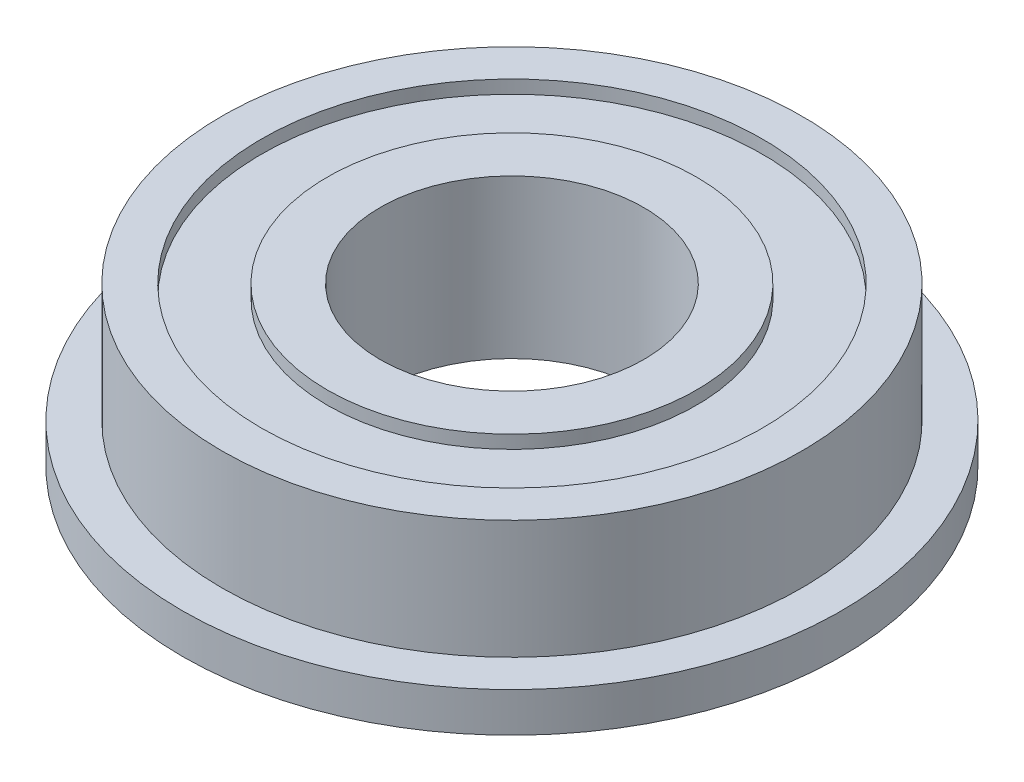
ISO-10303-21;
HEADER;
FILE_DESCRIPTION(('STEP AP214'),'2;1');
FILE_NAME('part.step','',(''),(''),'','','');
FILE_SCHEMA(('AUTOMOTIVE_DESIGN { 1 0 10303 214 1 1 1 1 }'));
ENDSEC;
DATA;
#1=APPLICATION_CONTEXT('core data for automotive mechanical design processes');
#2=APPLICATION_PROTOCOL_DEFINITION('international standard','automotive_design',2000,#1);
#3=PRODUCT_CONTEXT('',#1,'mechanical');
#4=PRODUCT('Part','Part','',(#3));
#5=PRODUCT_RELATED_PRODUCT_CATEGORY('part','',(#4));
#6=PRODUCT_DEFINITION_FORMATION('','',#4);
#7=PRODUCT_DEFINITION_CONTEXT('part definition',#1,'design');
#8=PRODUCT_DEFINITION('design','',#6,#7);
#9=PRODUCT_DEFINITION_SHAPE('','',#8);
#10=(LENGTH_UNIT() NAMED_UNIT(*) SI_UNIT(.MILLI.,.METRE.));
#11=(NAMED_UNIT(*) PLANE_ANGLE_UNIT() SI_UNIT($,.RADIAN.));
#12=(NAMED_UNIT(*) SI_UNIT($,.STERADIAN.) SOLID_ANGLE_UNIT());
#13=UNCERTAINTY_MEASURE_WITH_UNIT(LENGTH_MEASURE(1.E-05),#10,'distance_accuracy_value','');
#14=(GEOMETRIC_REPRESENTATION_CONTEXT(3) GLOBAL_UNCERTAINTY_ASSIGNED_CONTEXT((#13)) GLOBAL_UNIT_ASSIGNED_CONTEXT((#10,
#11,#12)) REPRESENTATION_CONTEXT('',''));
#15=CARTESIAN_POINT('',(0.,0.,0.));
#16=DIRECTION('',(0.,0.,1.));
#17=DIRECTION('',(1.,0.,0.));
#18=AXIS2_PLACEMENT_3D('',#15,#16,#17);
#19=CARTESIAN_POINT('',(0.,6.,0.));
#20=DIRECTION('',(0.,1.,0.));
#21=DIRECTION('',(0.,0.,1.));
#22=AXIS2_PLACEMENT_3D('',#19,#20,#21);
#23=PLANE('',#22);
#24=CARTESIAN_POINT('',(0.,6.,0.));
#25=DIRECTION('',(0.,1.,0.));
#26=DIRECTION('',(0.,0.,1.));
#27=AXIS2_PLACEMENT_3D('',#24,#25,#26);
#28=CIRCLE('',#27,5.);
#29=CARTESIAN_POINT('',(0.,6.,5.));
#30=VERTEX_POINT('',#29);
#31=EDGE_CURVE('E56',#30,#30,#28,.T.);
#32=ORIENTED_EDGE('',*,*,#31,.F.);
#33=EDGE_LOOP('',(#32));
#34=FACE_BOUND('',#33,.T.);
#35=CARTESIAN_POINT('',(0.,6.,0.));
#36=DIRECTION('',(0.,1.,0.));
#37=DIRECTION('',(0.,0.,1.));
#38=AXIS2_PLACEMENT_3D('',#35,#36,#37);
#39=CIRCLE('',#38,7.);
#40=CARTESIAN_POINT('',(0.,6.,7.));
#41=VERTEX_POINT('',#40);
#42=EDGE_CURVE('E78',#41,#41,#39,.T.);
#43=ORIENTED_EDGE('',*,*,#42,.T.);
#44=EDGE_LOOP('',(#43));
#45=FACE_BOUND('',#44,.T.);
#46=ADVANCED_FACE('F36',(#34,#45),#23,.T.);
#47=CARTESIAN_POINT('',(0.,0.,0.));
#48=DIRECTION('',(0.,1.,0.));
#49=DIRECTION('',(0.,0.,1.));
#50=AXIS2_PLACEMENT_3D('',#47,#48,#49);
#51=PLANE('',#50);
#52=CARTESIAN_POINT('',(0.,0.,0.));
#53=DIRECTION('',(0.,1.,0.));
#54=DIRECTION('',(0.,0.,1.));
#55=AXIS2_PLACEMENT_3D('',#52,#53,#54);
#56=CIRCLE('',#55,5.);
#57=CARTESIAN_POINT('',(0.,0.,5.));
#58=VERTEX_POINT('',#57);
#59=EDGE_CURVE('E53',#58,#58,#56,.T.);
#60=ORIENTED_EDGE('',*,*,#59,.T.);
#61=EDGE_LOOP('',(#60));
#62=FACE_BOUND('',#61,.T.);
#63=CARTESIAN_POINT('',(0.,0.,0.));
#64=DIRECTION('',(0.,-1.,0.));
#65=DIRECTION('',(0.,0.,-1.));
#66=AXIS2_PLACEMENT_3D('',#63,#64,#65);
#67=CIRCLE('',#66,7.);
#68=CARTESIAN_POINT('',(0.,0.,-7.));
#69=VERTEX_POINT('',#68);
#70=EDGE_CURVE('E66',#69,#69,#67,.T.);
#71=ORIENTED_EDGE('',*,*,#70,.T.);
#72=EDGE_LOOP('',(#71));
#73=FACE_BOUND('',#72,.T.);
#74=ADVANCED_FACE('F116',(#62,#73),#51,.F.);
#75=CARTESIAN_POINT('',(0.,1.5,0.));
#76=DIRECTION('',(0.,-1.,0.));
#77=DIRECTION('',(0.,0.,-1.));
#78=AXIS2_PLACEMENT_3D('',#75,#76,#77);
#79=CYLINDRICAL_SURFACE('',#78,12.5);
#80=CARTESIAN_POINT('',(0.,1.5,0.));
#81=DIRECTION('',(0.,1.,0.));
#82=DIRECTION('',(0.,0.,1.));
#83=AXIS2_PLACEMENT_3D('',#80,#81,#82);
#84=CIRCLE('',#83,12.5);
#85=CARTESIAN_POINT('',(0.,1.5,12.5));
#86=VERTEX_POINT('',#85);
#87=EDGE_CURVE('E44',#86,#86,#84,.T.);
#88=ORIENTED_EDGE('',*,*,#87,.F.);
#89=EDGE_LOOP('',(#88));
#90=FACE_BOUND('',#89,.T.);
#91=CARTESIAN_POINT('',(0.,0.,0.));
#92=DIRECTION('',(0.,1.,0.));
#93=DIRECTION('',(0.,0.,1.));
#94=AXIS2_PLACEMENT_3D('',#91,#92,#93);
#95=CIRCLE('',#94,12.5);
#96=CARTESIAN_POINT('',(0.,0.,12.5));
#97=VERTEX_POINT('',#96);
#98=EDGE_CURVE('E40',#97,#97,#95,.T.);
#99=ORIENTED_EDGE('',*,*,#98,.T.);
#100=EDGE_LOOP('',(#99));
#101=FACE_BOUND('',#100,.T.);
#102=ADVANCED_FACE('F38',(#90,#101),#79,.T.);
#103=CARTESIAN_POINT('',(0.,1.5,0.));
#104=DIRECTION('',(0.,1.,0.));
#105=DIRECTION('',(0.,0.,1.));
#106=AXIS2_PLACEMENT_3D('',#103,#104,#105);
#107=PLANE('',#106);
#108=CARTESIAN_POINT('',(0.,1.5,0.));
#109=DIRECTION('',(0.,1.,0.));
#110=DIRECTION('',(0.,0.,1.));
#111=AXIS2_PLACEMENT_3D('',#108,#109,#110);
#112=CIRCLE('',#111,11.);
#113=CARTESIAN_POINT('',(0.,1.5,11.));
#114=VERTEX_POINT('',#113);
#115=EDGE_CURVE('E10',#114,#114,#112,.T.);
#116=ORIENTED_EDGE('',*,*,#115,.F.);
#117=EDGE_LOOP('',(#116));
#118=FACE_BOUND('',#117,.T.);
#119=ORIENTED_EDGE('',*,*,#87,.T.);
#120=EDGE_LOOP('',(#119));
#121=FACE_BOUND('',#120,.T.);
#122=ADVANCED_FACE('F114',(#118,#121),#107,.T.);
#123=CARTESIAN_POINT('',(0.,0.,0.));
#124=DIRECTION('',(0.,-1.,0.));
#125=DIRECTION('',(0.,0.,-1.));
#126=AXIS2_PLACEMENT_3D('',#123,#124,#125);
#127=CIRCLE('',#126,9.5);
#128=CARTESIAN_POINT('',(0.,0.,-9.5));
#129=VERTEX_POINT('',#128);
#130=EDGE_CURVE('E60',#129,#129,#127,.T.);
#131=ORIENTED_EDGE('',*,*,#130,.F.);
#132=EDGE_LOOP('',(#131));
#133=FACE_BOUND('',#132,.T.);
#134=ORIENTED_EDGE('',*,*,#98,.F.);
#135=EDGE_LOOP('',(#134));
#136=FACE_BOUND('',#135,.T.);
#137=ADVANCED_FACE('F109',(#133,#136),#51,.F.);
#138=CARTESIAN_POINT('',(0.,6.,0.));
#139=DIRECTION('',(0.,-1.,0.));
#140=DIRECTION('',(0.,0.,-1.));
#141=AXIS2_PLACEMENT_3D('',#138,#139,#140);
#142=CYLINDRICAL_SURFACE('',#141,11.);
#143=CARTESIAN_POINT('',(0.,6.,0.));
#144=DIRECTION('',(0.,1.,0.));
#145=DIRECTION('',(0.,0.,1.));
#146=AXIS2_PLACEMENT_3D('',#143,#144,#145);
#147=CIRCLE('',#146,11.);
#148=CARTESIAN_POINT('',(0.,6.,11.));
#149=VERTEX_POINT('',#148);
#150=EDGE_CURVE('E50',#149,#149,#147,.T.);
#151=ORIENTED_EDGE('',*,*,#150,.F.);
#152=EDGE_LOOP('',(#151));
#153=FACE_BOUND('',#152,.T.);
#154=ORIENTED_EDGE('',*,*,#115,.T.);
#155=EDGE_LOOP('',(#154));
#156=FACE_BOUND('',#155,.T.);
#157=ADVANCED_FACE('F104',(#153,#156),#142,.T.);
#158=CARTESIAN_POINT('',(0.,6.,0.));
#159=DIRECTION('',(0.,1.,0.));
#160=DIRECTION('',(0.,0.,1.));
#161=AXIS2_PLACEMENT_3D('',#158,#159,#160);
#162=CIRCLE('',#161,9.5);
#163=CARTESIAN_POINT('',(0.,6.,9.5));
#164=VERTEX_POINT('',#163);
#165=EDGE_CURVE('E72',#164,#164,#162,.T.);
#166=ORIENTED_EDGE('',*,*,#165,.F.);
#167=EDGE_LOOP('',(#166));
#168=FACE_BOUND('',#167,.T.);
#169=ORIENTED_EDGE('',*,*,#150,.T.);
#170=EDGE_LOOP('',(#169));
#171=FACE_BOUND('',#170,.T.);
#172=ADVANCED_FACE('F100',(#168,#171),#23,.T.);
#173=CARTESIAN_POINT('',(0.,-3.,0.));
#174=DIRECTION('',(0.,1.,0.));
#175=DIRECTION('',(0.,0.,1.));
#176=AXIS2_PLACEMENT_3D('',#173,#174,#175);
#177=CYLINDRICAL_SURFACE('',#176,5.);
#178=ORIENTED_EDGE('',*,*,#31,.T.);
#179=EDGE_LOOP('',(#178));
#180=FACE_BOUND('',#179,.T.);
#181=ORIENTED_EDGE('',*,*,#59,.F.);
#182=EDGE_LOOP('',(#181));
#183=FACE_BOUND('',#182,.T.);
#184=ADVANCED_FACE('F103',(#180,#183),#177,.F.);
#185=CARTESIAN_POINT('',(0.,0.5,0.));
#186=DIRECTION('',(0.,-1.,0.));
#187=DIRECTION('',(0.,0.,-1.));
#188=AXIS2_PLACEMENT_3D('',#185,#186,#187);
#189=CYLINDRICAL_SURFACE('',#188,9.5);
#190=CARTESIAN_POINT('',(0.,0.5,0.));
#191=DIRECTION('',(0.,-1.,0.));
#192=DIRECTION('',(0.,0.,-1.));
#193=AXIS2_PLACEMENT_3D('',#190,#191,#192);
#194=CIRCLE('',#193,9.5);
#195=CARTESIAN_POINT('',(0.,0.5,-9.5));
#196=VERTEX_POINT('',#195);
#197=EDGE_CURVE('E59',#196,#196,#194,.T.);
#198=ORIENTED_EDGE('',*,*,#197,.F.);
#199=EDGE_LOOP('',(#198));
#200=FACE_BOUND('',#199,.T.);
#201=ORIENTED_EDGE('',*,*,#130,.T.);
#202=EDGE_LOOP('',(#201));
#203=FACE_BOUND('',#202,.T.);
#204=ADVANCED_FACE('F129',(#200,#203),#189,.F.);
#205=CARTESIAN_POINT('',(0.,0.5,0.));
#206=DIRECTION('',(0.,-1.,0.));
#207=DIRECTION('',(0.,0.,-1.));
#208=AXIS2_PLACEMENT_3D('',#205,#206,#207);
#209=PLANE('',#208);
#210=CARTESIAN_POINT('',(0.,0.5,0.));
#211=DIRECTION('',(0.,-1.,0.));
#212=DIRECTION('',(0.,0.,-1.));
#213=AXIS2_PLACEMENT_3D('',#210,#211,#212);
#214=CIRCLE('',#213,7.);
#215=CARTESIAN_POINT('',(0.,0.5,-7.));
#216=VERTEX_POINT('',#215);
#217=EDGE_CURVE('E63',#216,#216,#214,.T.);
#218=ORIENTED_EDGE('',*,*,#217,.F.);
#219=EDGE_LOOP('',(#218));
#220=FACE_BOUND('',#219,.T.);
#221=ORIENTED_EDGE('',*,*,#197,.T.);
#222=EDGE_LOOP('',(#221));
#223=FACE_BOUND('',#222,.T.);
#224=ADVANCED_FACE('F133',(#220,#223),#209,.T.);
#225=CARTESIAN_POINT('',(0.,0.5,0.));
#226=DIRECTION('',(0.,-1.,0.));
#227=DIRECTION('',(0.,0.,-1.));
#228=AXIS2_PLACEMENT_3D('',#225,#226,#227);
#229=CYLINDRICAL_SURFACE('',#228,7.);
#230=ORIENTED_EDGE('',*,*,#217,.T.);
#231=EDGE_LOOP('',(#230));
#232=FACE_BOUND('',#231,.T.);
#233=ORIENTED_EDGE('',*,*,#70,.F.);
#234=EDGE_LOOP('',(#233));
#235=FACE_BOUND('',#234,.T.);
#236=ADVANCED_FACE('F96',(#232,#235),#229,.T.);
#237=CARTESIAN_POINT('',(0.,5.5,0.));
#238=DIRECTION('',(0.,1.,0.));
#239=DIRECTION('',(0.,0.,1.));
#240=AXIS2_PLACEMENT_3D('',#237,#238,#239);
#241=CYLINDRICAL_SURFACE('',#240,9.5);
#242=CARTESIAN_POINT('',(0.,5.5,0.));
#243=DIRECTION('',(0.,1.,0.));
#244=DIRECTION('',(0.,0.,1.));
#245=AXIS2_PLACEMENT_3D('',#242,#243,#244);
#246=CIRCLE('',#245,9.5);
#247=CARTESIAN_POINT('',(0.,5.5,9.5));
#248=VERTEX_POINT('',#247);
#249=EDGE_CURVE('E69',#248,#248,#246,.T.);
#250=ORIENTED_EDGE('',*,*,#249,.F.);
#251=EDGE_LOOP('',(#250));
#252=FACE_BOUND('',#251,.T.);
#253=ORIENTED_EDGE('',*,*,#165,.T.);
#254=EDGE_LOOP('',(#253));
#255=FACE_BOUND('',#254,.T.);
#256=ADVANCED_FACE('F90',(#252,#255),#241,.F.);
#257=CARTESIAN_POINT('',(0.,5.5,0.));
#258=DIRECTION('',(0.,1.,0.));
#259=DIRECTION('',(0.,0.,1.));
#260=AXIS2_PLACEMENT_3D('',#257,#258,#259);
#261=PLANE('',#260);
#262=CARTESIAN_POINT('',(0.,5.5,0.));
#263=DIRECTION('',(0.,1.,0.));
#264=DIRECTION('',(0.,0.,1.));
#265=AXIS2_PLACEMENT_3D('',#262,#263,#264);
#266=CIRCLE('',#265,7.);
#267=CARTESIAN_POINT('',(0.,5.5,7.));
#268=VERTEX_POINT('',#267);
#269=EDGE_CURVE('E75',#268,#268,#266,.T.);
#270=ORIENTED_EDGE('',*,*,#269,.F.);
#271=EDGE_LOOP('',(#270));
#272=FACE_BOUND('',#271,.T.);
#273=ORIENTED_EDGE('',*,*,#249,.T.);
#274=EDGE_LOOP('',(#273));
#275=FACE_BOUND('',#274,.T.);
#276=ADVANCED_FACE('F87',(#272,#275),#261,.T.);
#277=CARTESIAN_POINT('',(0.,5.5,0.));
#278=DIRECTION('',(0.,1.,0.));
#279=DIRECTION('',(0.,0.,1.));
#280=AXIS2_PLACEMENT_3D('',#277,#278,#279);
#281=CYLINDRICAL_SURFACE('',#280,7.);
#282=ORIENTED_EDGE('',*,*,#269,.T.);
#283=EDGE_LOOP('',(#282));
#284=FACE_BOUND('',#283,.T.);
#285=ORIENTED_EDGE('',*,*,#42,.F.);
#286=EDGE_LOOP('',(#285));
#287=FACE_BOUND('',#286,.T.);
#288=ADVANCED_FACE('F84',(#284,#287),#281,.T.);
#289=CLOSED_SHELL('',(#46,#74,#102,#122,#137,#157,#172,#184,#204,#224,#236,#256,#276,#288));
#290=MANIFOLD_SOLID_BREP('B2',#289);
#291=ADVANCED_BREP_SHAPE_REPRESENTATION('',(#18,#290),#14);
#292=SHAPE_DEFINITION_REPRESENTATION(#9,#291);
ENDSEC;
END-ISO-10303-21;
